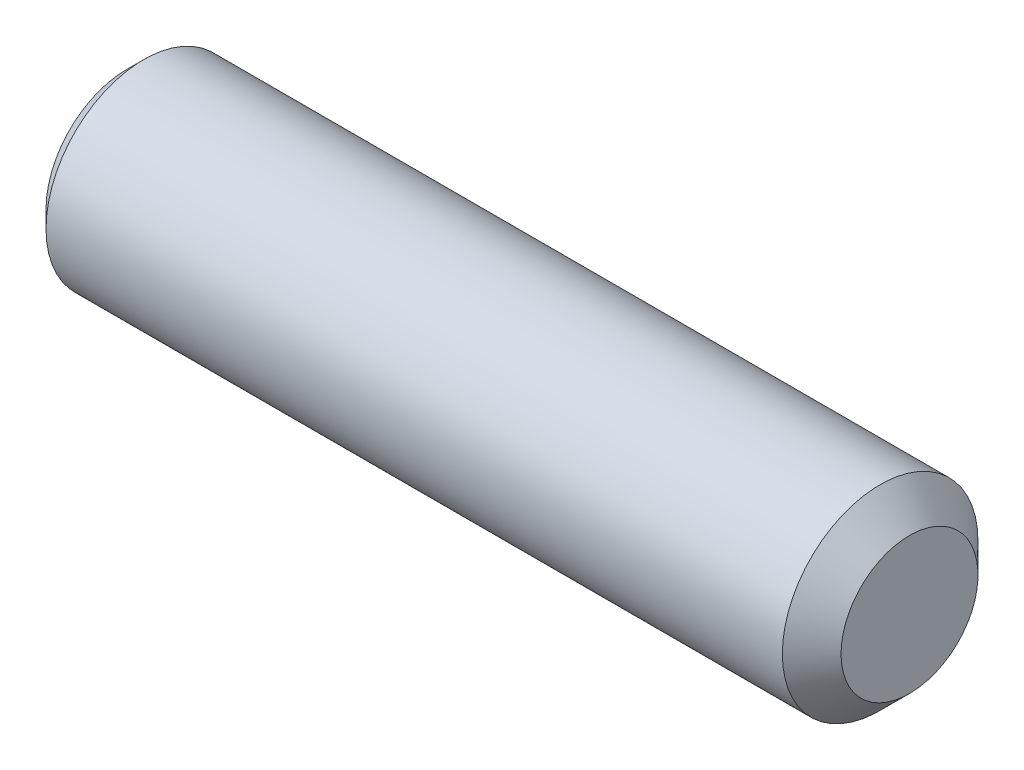
ISO-10303-21;
HEADER;
FILE_DESCRIPTION(('STEP AP214'),'2;1');
FILE_NAME('part.step','',(''),(''),'','','');
FILE_SCHEMA(('AUTOMOTIVE_DESIGN { 1 0 10303 214 1 1 1 1 }'));
ENDSEC;
DATA;
#1=APPLICATION_CONTEXT('core data for automotive mechanical design processes');
#2=APPLICATION_PROTOCOL_DEFINITION('international standard','automotive_design',2000,#1);
#3=PRODUCT_CONTEXT('',#1,'mechanical');
#4=PRODUCT('Part','Part','',(#3));
#5=PRODUCT_RELATED_PRODUCT_CATEGORY('part','',(#4));
#6=PRODUCT_DEFINITION_FORMATION('','',#4);
#7=PRODUCT_DEFINITION_CONTEXT('part definition',#1,'design');
#8=PRODUCT_DEFINITION('design','',#6,#7);
#9=PRODUCT_DEFINITION_SHAPE('','',#8);
#10=(LENGTH_UNIT() NAMED_UNIT(*) SI_UNIT(.MILLI.,.METRE.));
#11=(NAMED_UNIT(*) PLANE_ANGLE_UNIT() SI_UNIT($,.RADIAN.));
#12=(NAMED_UNIT(*) SI_UNIT($,.STERADIAN.) SOLID_ANGLE_UNIT());
#13=UNCERTAINTY_MEASURE_WITH_UNIT(LENGTH_MEASURE(1.E-05),#10,'distance_accuracy_value','');
#14=(GEOMETRIC_REPRESENTATION_CONTEXT(3) GLOBAL_UNCERTAINTY_ASSIGNED_CONTEXT((#13)) GLOBAL_UNIT_ASSIGNED_CONTEXT((#10,
#11,#12)) REPRESENTATION_CONTEXT('',''));
#15=CARTESIAN_POINT('',(0.,0.,0.));
#16=DIRECTION('',(0.,0.,1.));
#17=DIRECTION('',(1.,0.,0.));
#18=AXIS2_PLACEMENT_3D('',#15,#16,#17);
#19=CARTESIAN_POINT('',(2.00000000011369,1.25,2.1650635094611));
#20=DIRECTION('',(-1.,0.,0.));
#21=DIRECTION('',(0.,0.,1.));
#22=AXIS2_PLACEMENT_3D('',#19,#20,#21);
#23=PLANE('',#22);
#24=CARTESIAN_POINT('',(2.00000000011369,0.,0.));
#25=DIRECTION('',(-1.,0.,0.));
#26=DIRECTION('',(0.,0.,1.));
#27=AXIS2_PLACEMENT_3D('',#24,#25,#26);
#28=CIRCLE('',#27,1.25);
#29=CARTESIAN_POINT('',(2.00000000011369,0.625,1.08253175473055));
#30=VERTEX_POINT('',#29);
#31=CARTESIAN_POINT('',(2.00000000011369,1.25,0.));
#32=VERTEX_POINT('',#31);
#33=EDGE_CURVE('E48',#30,#32,#28,.T.);
#34=ORIENTED_EDGE('',*,*,#33,.F.);
#35=DIRECTION('',(0.,0.866025403784439,-0.5));
#36=VECTOR('',#35,1.);
#37=CARTESIAN_POINT('',(2.00000000011369,0.,1.44337567297406));
#38=LINE('',#37,#36);
#39=CARTESIAN_POINT('',(2.00000000011369,1.25,0.721687836487033));
#40=VERTEX_POINT('',#39);
#41=EDGE_CURVE('E237',#30,#40,#38,.T.);
#42=ORIENTED_EDGE('',*,*,#41,.T.);
#43=DIRECTION('',(0.,0.,-1.));
#44=VECTOR('',#43,1.);
#45=CARTESIAN_POINT('',(2.00000000011369,1.25,0.721687836487033));
#46=LINE('',#45,#44);
#47=EDGE_CURVE('E230',#40,#32,#46,.T.);
#48=ORIENTED_EDGE('',*,*,#47,.T.);
#49=EDGE_LOOP('',(#34,#42,#48));
#50=FACE_BOUND('',#49,.T.);
#51=ADVANCED_FACE('F37',(#50),#23,.T.);
#52=CARTESIAN_POINT('',(2.00000000011369,0.625,-1.08253175473055));
#53=VERTEX_POINT('',#52);
#54=EDGE_CURVE('E11',#32,#53,#28,.T.);
#55=ORIENTED_EDGE('',*,*,#54,.F.);
#56=CARTESIAN_POINT('',(2.00000000011369,1.25,-0.721687836487032));
#57=VERTEX_POINT('',#56);
#58=EDGE_CURVE('E233',#32,#57,#46,.T.);
#59=ORIENTED_EDGE('',*,*,#58,.T.);
#60=DIRECTION('',(0.,-0.866025403784439,-0.5));
#61=VECTOR('',#60,1.);
#62=CARTESIAN_POINT('',(2.00000000011369,1.25,-0.721687836487032));
#63=LINE('',#62,#61);
#64=EDGE_CURVE('E226',#57,#53,#63,.T.);
#65=ORIENTED_EDGE('',*,*,#64,.T.);
#66=EDGE_LOOP('',(#55,#59,#65));
#67=FACE_BOUND('',#66,.T.);
#68=ADVANCED_FACE('F124',(#67),#23,.T.);
#69=CARTESIAN_POINT('',(2.00000000011369,-0.625,-1.08253175473055));
#70=VERTEX_POINT('',#69);
#71=EDGE_CURVE('E46',#53,#70,#28,.T.);
#72=ORIENTED_EDGE('',*,*,#71,.F.);
#73=CARTESIAN_POINT('',(2.00000000011369,0.,-1.44337567297406));
#74=VERTEX_POINT('',#73);
#75=EDGE_CURVE('E229',#53,#74,#63,.T.);
#76=ORIENTED_EDGE('',*,*,#75,.T.);
#77=DIRECTION('',(0.,-0.866025403784439,0.5));
#78=VECTOR('',#77,1.);
#79=CARTESIAN_POINT('',(2.00000000011369,0.,-1.44337567297406));
#80=LINE('',#79,#78);
#81=EDGE_CURVE('E222',#74,#70,#80,.T.);
#82=ORIENTED_EDGE('',*,*,#81,.T.);
#83=EDGE_LOOP('',(#72,#76,#82));
#84=FACE_BOUND('',#83,.T.);
#85=ADVANCED_FACE('F129',(#84),#23,.T.);
#86=CARTESIAN_POINT('',(2.00000000011369,-1.25,0.));
#87=VERTEX_POINT('',#86);
#88=EDGE_CURVE('E260',#70,#87,#28,.T.);
#89=ORIENTED_EDGE('',*,*,#88,.F.);
#90=CARTESIAN_POINT('',(2.00000000011369,-1.25,-0.721687836487033));
#91=VERTEX_POINT('',#90);
#92=EDGE_CURVE('E225',#70,#91,#80,.T.);
#93=ORIENTED_EDGE('',*,*,#92,.T.);
#94=DIRECTION('',(0.,0.,1.));
#95=VECTOR('',#94,1.);
#96=CARTESIAN_POINT('',(2.00000000011369,-1.25,-0.721687836487033));
#97=LINE('',#96,#95);
#98=EDGE_CURVE('E193',#91,#87,#97,.T.);
#99=ORIENTED_EDGE('',*,*,#98,.T.);
#100=EDGE_LOOP('',(#89,#93,#99));
#101=FACE_BOUND('',#100,.T.);
#102=ADVANCED_FACE('F268',(#101),#23,.T.);
#103=CARTESIAN_POINT('',(2.00000000011369,-0.625,1.08253175473055));
#104=VERTEX_POINT('',#103);
#105=EDGE_CURVE('E55',#87,#104,#28,.T.);
#106=ORIENTED_EDGE('',*,*,#105,.F.);
#107=CARTESIAN_POINT('',(2.00000000011369,-1.25,0.721687836487033));
#108=VERTEX_POINT('',#107);
#109=EDGE_CURVE('E221',#87,#108,#97,.T.);
#110=ORIENTED_EDGE('',*,*,#109,.T.);
#111=DIRECTION('',(0.,0.866025403784439,0.5));
#112=VECTOR('',#111,1.);
#113=CARTESIAN_POINT('',(2.00000000011369,-1.25,0.721687836487033));
#114=LINE('',#113,#112);
#115=EDGE_CURVE('E238',#108,#104,#114,.T.);
#116=ORIENTED_EDGE('',*,*,#115,.T.);
#117=EDGE_LOOP('',(#106,#110,#116));
#118=FACE_BOUND('',#117,.T.);
#119=ADVANCED_FACE('F122',(#118),#23,.T.);
#120=CARTESIAN_POINT('',(0.,2.067,0.));
#121=DIRECTION('',(1.,0.,0.));
#122=DIRECTION('',(0.,0.,-1.));
#123=AXIS2_PLACEMENT_3D('',#120,#121,#122);
#124=PLANE('',#123);
#125=DIRECTION('',(0.,0.866025403784439,-0.5));
#126=VECTOR('',#125,1.);
#127=CARTESIAN_POINT('',(1.13686837721616E-10,0.,1.44337567297406));
#128=LINE('',#127,#126);
#129=CARTESIAN_POINT('',(0.,0.,1.44337567297406));
#130=VERTEX_POINT('',#129);
#131=CARTESIAN_POINT('',(1.13686837721616E-10,1.25,0.721687836487033));
#132=VERTEX_POINT('',#131);
#133=EDGE_CURVE('E215',#130,#132,#128,.T.);
#134=ORIENTED_EDGE('',*,*,#133,.F.);
#135=DIRECTION('',(0.,0.866025403784439,0.5));
#136=VECTOR('',#135,1.);
#137=CARTESIAN_POINT('',(1.13686837721616E-10,-1.25,0.721687836487033));
#138=LINE('',#137,#136);
#139=CARTESIAN_POINT('',(1.13686837721616E-10,-1.25,0.721687836487033));
#140=VERTEX_POINT('',#139);
#141=EDGE_CURVE('E63',#140,#130,#138,.T.);
#142=ORIENTED_EDGE('',*,*,#141,.F.);
#143=DIRECTION('',(0.,0.,1.));
#144=VECTOR('',#143,1.);
#145=CARTESIAN_POINT('',(1.13686837721616E-10,-1.25,-0.721687836487033));
#146=LINE('',#145,#144);
#147=CARTESIAN_POINT('',(1.13686837721616E-10,-1.25,-0.721687836487033));
#148=VERTEX_POINT('',#147);
#149=EDGE_CURVE('E202',#148,#140,#146,.T.);
#150=ORIENTED_EDGE('',*,*,#149,.F.);
#151=DIRECTION('',(0.,-0.866025403784439,0.5));
#152=VECTOR('',#151,1.);
#153=CARTESIAN_POINT('',(1.13686837721616E-10,0.,-1.44337567297406));
#154=LINE('',#153,#152);
#155=CARTESIAN_POINT('',(1.13686837721616E-10,0.,-1.44337567297406));
#156=VERTEX_POINT('',#155);
#157=EDGE_CURVE('E206',#156,#148,#154,.T.);
#158=ORIENTED_EDGE('',*,*,#157,.F.);
#159=DIRECTION('',(0.,-0.866025403784439,-0.5));
#160=VECTOR('',#159,1.);
#161=CARTESIAN_POINT('',(1.13686837721616E-10,1.25,-0.721687836487032));
#162=LINE('',#161,#160);
#163=CARTESIAN_POINT('',(1.13686837721616E-10,1.25,-0.721687836487032));
#164=VERTEX_POINT('',#163);
#165=EDGE_CURVE('E209',#164,#156,#162,.T.);
#166=ORIENTED_EDGE('',*,*,#165,.F.);
#167=DIRECTION('',(0.,0.,-1.));
#168=VECTOR('',#167,1.);
#169=CARTESIAN_POINT('',(1.13686837721616E-10,1.25,0.721687836487033));
#170=LINE('',#169,#168);
#171=EDGE_CURVE('E212',#132,#164,#170,.T.);
#172=ORIENTED_EDGE('',*,*,#171,.F.);
#173=EDGE_LOOP('',(#134,#142,#150,#158,#166,#172));
#174=FACE_BOUND('',#173,.T.);
#175=CARTESIAN_POINT('',(0.,0.,0.));
#176=DIRECTION('',(-1.,0.,0.));
#177=DIRECTION('',(0.,0.,1.));
#178=AXIS2_PLACEMENT_3D('',#175,#176,#177);
#179=CIRCLE('',#178,2.067);
#180=CARTESIAN_POINT('',(0.,0.,2.067));
#181=VERTEX_POINT('',#180);
#182=EDGE_CURVE('E183',#181,#181,#179,.T.);
#183=ORIENTED_EDGE('',*,*,#182,.T.);
#184=EDGE_LOOP('',(#183));
#185=FACE_BOUND('',#184,.T.);
#186=ADVANCED_FACE('F39',(#174,#185),#124,.F.);
#187=CARTESIAN_POINT('',(20.,0.,0.));
#188=DIRECTION('',(-1.,0.,0.));
#189=DIRECTION('',(0.,0.,1.));
#190=AXIS2_PLACEMENT_3D('',#187,#188,#189);
#191=PLANE('',#190);
#192=CARTESIAN_POINT('',(20.,0.,0.));
#193=DIRECTION('',(-1.,0.,0.));
#194=DIRECTION('',(0.,0.,1.));
#195=AXIS2_PLACEMENT_3D('',#192,#193,#194);
#196=CIRCLE('',#195,1.75);
#197=CARTESIAN_POINT('',(20.,0.,1.75));
#198=VERTEX_POINT('',#197);
#199=EDGE_CURVE('E41',#198,#198,#196,.T.);
#200=ORIENTED_EDGE('',*,*,#199,.F.);
#201=EDGE_LOOP('',(#200));
#202=FACE_BOUND('',#201,.T.);
#203=ADVANCED_FACE('F165',(#202),#191,.F.);
#204=CARTESIAN_POINT('',(20.,0.,0.));
#205=DIRECTION('',(-1.,0.,0.));
#206=DIRECTION('',(0.,0.,1.));
#207=AXIS2_PLACEMENT_3D('',#204,#205,#206);
#208=CONICAL_SURFACE('',#207,1.75,0.785398163397443);
#209=CARTESIAN_POINT('',(19.25,0.,0.));
#210=DIRECTION('',(-1.,0.,0.));
#211=DIRECTION('',(0.,0.,1.));
#212=AXIS2_PLACEMENT_3D('',#209,#210,#211);
#213=CIRCLE('',#212,2.5);
#214=CARTESIAN_POINT('',(19.25,0.,2.5));
#215=VERTEX_POINT('',#214);
#216=EDGE_CURVE('E177',#215,#215,#213,.T.);
#217=ORIENTED_EDGE('',*,*,#216,.F.);
#218=EDGE_LOOP('',(#217));
#219=FACE_BOUND('',#218,.T.);
#220=ORIENTED_EDGE('',*,*,#199,.T.);
#221=EDGE_LOOP('',(#220));
#222=FACE_BOUND('',#221,.T.);
#223=ADVANCED_FACE('F162',(#219,#222),#208,.T.);
#224=CARTESIAN_POINT('',(-10.7450145430878,0.,0.));
#225=DIRECTION('',(-1.,0.,0.));
#226=DIRECTION('',(0.,0.,1.));
#227=AXIS2_PLACEMENT_3D('',#224,#225,#226);
#228=CYLINDRICAL_SURFACE('',#227,2.5);
#229=CARTESIAN_POINT('',(0.433000000000001,0.,0.));
#230=DIRECTION('',(-1.,0.,0.));
#231=DIRECTION('',(0.,0.,1.));
#232=AXIS2_PLACEMENT_3D('',#229,#230,#231);
#233=CIRCLE('',#232,2.5);
#234=CARTESIAN_POINT('',(0.433000000000001,0.,2.5));
#235=VERTEX_POINT('',#234);
#236=EDGE_CURVE('E179',#235,#235,#233,.T.);
#237=ORIENTED_EDGE('',*,*,#236,.F.);
#238=EDGE_LOOP('',(#237));
#239=FACE_BOUND('',#238,.T.);
#240=ORIENTED_EDGE('',*,*,#216,.T.);
#241=EDGE_LOOP('',(#240));
#242=FACE_BOUND('',#241,.T.);
#243=ADVANCED_FACE('F158',(#239,#242),#228,.T.);
#244=CARTESIAN_POINT('',(0.433000000000001,0.,0.));
#245=DIRECTION('',(1.,0.,0.));
#246=DIRECTION('',(0.,0.,-1.));
#247=AXIS2_PLACEMENT_3D('',#244,#245,#246);
#248=CONICAL_SURFACE('',#247,2.5,0.785398163397444);
#249=ORIENTED_EDGE('',*,*,#182,.F.);
#250=EDGE_LOOP('',(#249));
#251=FACE_BOUND('',#250,.T.);
#252=ORIENTED_EDGE('',*,*,#236,.T.);
#253=EDGE_LOOP('',(#252));
#254=FACE_BOUND('',#253,.T.);
#255=ADVANCED_FACE('F155',(#251,#254),#248,.T.);
#256=CARTESIAN_POINT('',(2.00000000011369,-1.25,0.721687836487033));
#257=DIRECTION('',(0.,-0.5,0.866025403784439));
#258=DIRECTION('',(0.,-0.866025403784439,-0.5));
#259=AXIS2_PLACEMENT_3D('',#256,#257,#258);
#260=PLANE('',#259);
#261=ORIENTED_EDGE('',*,*,#141,.T.);
#262=DIRECTION('',(-1.,0.,0.));
#263=VECTOR('',#262,1.);
#264=CARTESIAN_POINT('',(2.00000000011369,0.,1.44337567297406));
#265=LINE('',#264,#263);
#266=CARTESIAN_POINT('',(2.00000000011369,0.,1.44337567297406));
#267=VERTEX_POINT('',#266);
#268=EDGE_CURVE('E190',#267,#130,#265,.T.);
#269=ORIENTED_EDGE('',*,*,#268,.F.);
#270=EDGE_CURVE('E205',#104,#267,#114,.T.);
#271=ORIENTED_EDGE('',*,*,#270,.F.);
#272=ORIENTED_EDGE('',*,*,#115,.F.);
#273=DIRECTION('',(-1.,0.,0.));
#274=VECTOR('',#273,1.);
#275=CARTESIAN_POINT('',(2.00000000011369,-1.25,0.721687836487033));
#276=LINE('',#275,#274);
#277=EDGE_CURVE('E189',#108,#140,#276,.T.);
#278=ORIENTED_EDGE('',*,*,#277,.T.);
#279=EDGE_LOOP('',(#261,#269,#271,#272,#278));
#280=FACE_BOUND('',#279,.T.);
#281=ADVANCED_FACE('F137',(#280),#260,.F.);
#282=CARTESIAN_POINT('',(2.00000000011369,-1.25,-0.721687836487033));
#283=DIRECTION('',(0.,-1.,0.));
#284=DIRECTION('',(0.,0.,-1.));
#285=AXIS2_PLACEMENT_3D('',#282,#283,#284);
#286=PLANE('',#285);
#287=ORIENTED_EDGE('',*,*,#149,.T.);
#288=ORIENTED_EDGE('',*,*,#277,.F.);
#289=ORIENTED_EDGE('',*,*,#109,.F.);
#290=ORIENTED_EDGE('',*,*,#98,.F.);
#291=DIRECTION('',(-1.,0.,0.));
#292=VECTOR('',#291,1.);
#293=CARTESIAN_POINT('',(2.00000000011369,-1.25,-0.721687836487033));
#294=LINE('',#293,#292);
#295=EDGE_CURVE('E199',#91,#148,#294,.T.);
#296=ORIENTED_EDGE('',*,*,#295,.T.);
#297=EDGE_LOOP('',(#287,#288,#289,#290,#296));
#298=FACE_BOUND('',#297,.T.);
#299=ADVANCED_FACE('F133',(#298),#286,.F.);
#300=CARTESIAN_POINT('',(2.00000000011369,0.,-1.44337567297406));
#301=DIRECTION('',(0.,-0.5,-0.866025403784439));
#302=DIRECTION('',(0.,0.866025403784439,-0.5));
#303=AXIS2_PLACEMENT_3D('',#300,#301,#302);
#304=PLANE('',#303);
#305=ORIENTED_EDGE('',*,*,#157,.T.);
#306=ORIENTED_EDGE('',*,*,#295,.F.);
#307=ORIENTED_EDGE('',*,*,#92,.F.);
#308=ORIENTED_EDGE('',*,*,#81,.F.);
#309=DIRECTION('',(-1.,0.,0.));
#310=VECTOR('',#309,1.);
#311=CARTESIAN_POINT('',(2.00000000011369,0.,-1.44337567297406));
#312=LINE('',#311,#310);
#313=EDGE_CURVE('E197',#74,#156,#312,.T.);
#314=ORIENTED_EDGE('',*,*,#313,.T.);
#315=EDGE_LOOP('',(#305,#306,#307,#308,#314));
#316=FACE_BOUND('',#315,.T.);
#317=ADVANCED_FACE('F136',(#316),#304,.F.);
#318=CARTESIAN_POINT('',(2.00000000011369,1.25,-0.721687836487032));
#319=DIRECTION('',(0.,0.5,-0.866025403784439));
#320=DIRECTION('',(0.,0.866025403784439,0.5));
#321=AXIS2_PLACEMENT_3D('',#318,#319,#320);
#322=PLANE('',#321);
#323=ORIENTED_EDGE('',*,*,#165,.T.);
#324=ORIENTED_EDGE('',*,*,#313,.F.);
#325=ORIENTED_EDGE('',*,*,#75,.F.);
#326=ORIENTED_EDGE('',*,*,#64,.F.);
#327=DIRECTION('',(-1.,0.,0.));
#328=VECTOR('',#327,1.);
#329=CARTESIAN_POINT('',(2.00000000011369,1.25,-0.721687836487032));
#330=LINE('',#329,#328);
#331=EDGE_CURVE('E195',#57,#164,#330,.T.);
#332=ORIENTED_EDGE('',*,*,#331,.T.);
#333=EDGE_LOOP('',(#323,#324,#325,#326,#332));
#334=FACE_BOUND('',#333,.T.);
#335=ADVANCED_FACE('F141',(#334),#322,.F.);
#336=CARTESIAN_POINT('',(2.00000000011369,1.25,0.721687836487033));
#337=DIRECTION('',(0.,1.,0.));
#338=DIRECTION('',(0.,0.,1.));
#339=AXIS2_PLACEMENT_3D('',#336,#337,#338);
#340=PLANE('',#339);
#341=ORIENTED_EDGE('',*,*,#171,.T.);
#342=ORIENTED_EDGE('',*,*,#331,.F.);
#343=ORIENTED_EDGE('',*,*,#58,.F.);
#344=ORIENTED_EDGE('',*,*,#47,.F.);
#345=DIRECTION('',(-1.,0.,0.));
#346=VECTOR('',#345,1.);
#347=CARTESIAN_POINT('',(2.00000000011369,1.25,0.721687836487033));
#348=LINE('',#347,#346);
#349=EDGE_CURVE('E192',#40,#132,#348,.T.);
#350=ORIENTED_EDGE('',*,*,#349,.T.);
#351=EDGE_LOOP('',(#341,#342,#343,#344,#350));
#352=FACE_BOUND('',#351,.T.);
#353=ADVANCED_FACE('F145',(#352),#340,.F.);
#354=CARTESIAN_POINT('',(2.00000000011369,0.,1.44337567297406));
#355=DIRECTION('',(0.,0.5,0.866025403784439));
#356=DIRECTION('',(0.,-0.866025403784439,0.5));
#357=AXIS2_PLACEMENT_3D('',#354,#355,#356);
#358=PLANE('',#357);
#359=ORIENTED_EDGE('',*,*,#133,.T.);
#360=ORIENTED_EDGE('',*,*,#349,.F.);
#361=ORIENTED_EDGE('',*,*,#41,.F.);
#362=EDGE_CURVE('E234',#267,#30,#38,.T.);
#363=ORIENTED_EDGE('',*,*,#362,.F.);
#364=ORIENTED_EDGE('',*,*,#268,.T.);
#365=EDGE_LOOP('',(#359,#360,#361,#363,#364));
#366=FACE_BOUND('',#365,.T.);
#367=ADVANCED_FACE('F119',(#366),#358,.F.);
#368=EDGE_CURVE('E176',#104,#30,#28,.T.);
#369=ORIENTED_EDGE('',*,*,#368,.F.);
#370=ORIENTED_EDGE('',*,*,#270,.T.);
#371=ORIENTED_EDGE('',*,*,#362,.T.);
#372=EDGE_LOOP('',(#369,#370,#371));
#373=FACE_BOUND('',#372,.T.);
#374=ADVANCED_FACE('F114',(#373),#23,.T.);
#375=CARTESIAN_POINT('',(2.72168783660072,0.,0.));
#376=DIRECTION('',(-1.,0.,0.));
#377=DIRECTION('',(0.,0.,1.));
#378=AXIS2_PLACEMENT_3D('',#375,#376,#377);
#379=CONICAL_SURFACE('',#378,0.,1.0471975511966);
#380=ORIENTED_EDGE('',*,*,#33,.T.);
#381=ORIENTED_EDGE('',*,*,#54,.T.);
#382=ORIENTED_EDGE('',*,*,#71,.T.);
#383=ORIENTED_EDGE('',*,*,#88,.T.);
#384=ORIENTED_EDGE('',*,*,#105,.T.);
#385=ORIENTED_EDGE('',*,*,#368,.T.);
#386=EDGE_LOOP('',(#380,#381,#382,#383,#384,#385));
#387=FACE_BOUND('',#386,.T.);
#388=CARTESIAN_POINT('',(2.72168783660072,0.,0.));
#389=VERTEX_POINT('',#388);
#390=VERTEX_LOOP('',#389);
#391=FACE_BOUND('',#390,.T.);
#392=ADVANCED_FACE('F112',(#387,#391),#379,.F.);
#393=CLOSED_SHELL('',(#51,#68,#85,#102,#119,#186,#203,#223,#243,#255,#281,#299,#317,#335,#353,
#367,#374,#392));
#394=MANIFOLD_SOLID_BREP('B2',#393);
#395=ADVANCED_BREP_SHAPE_REPRESENTATION('',(#18,#394),#14);
#396=SHAPE_DEFINITION_REPRESENTATION(#9,#395);
ENDSEC;
END-ISO-10303-21;
